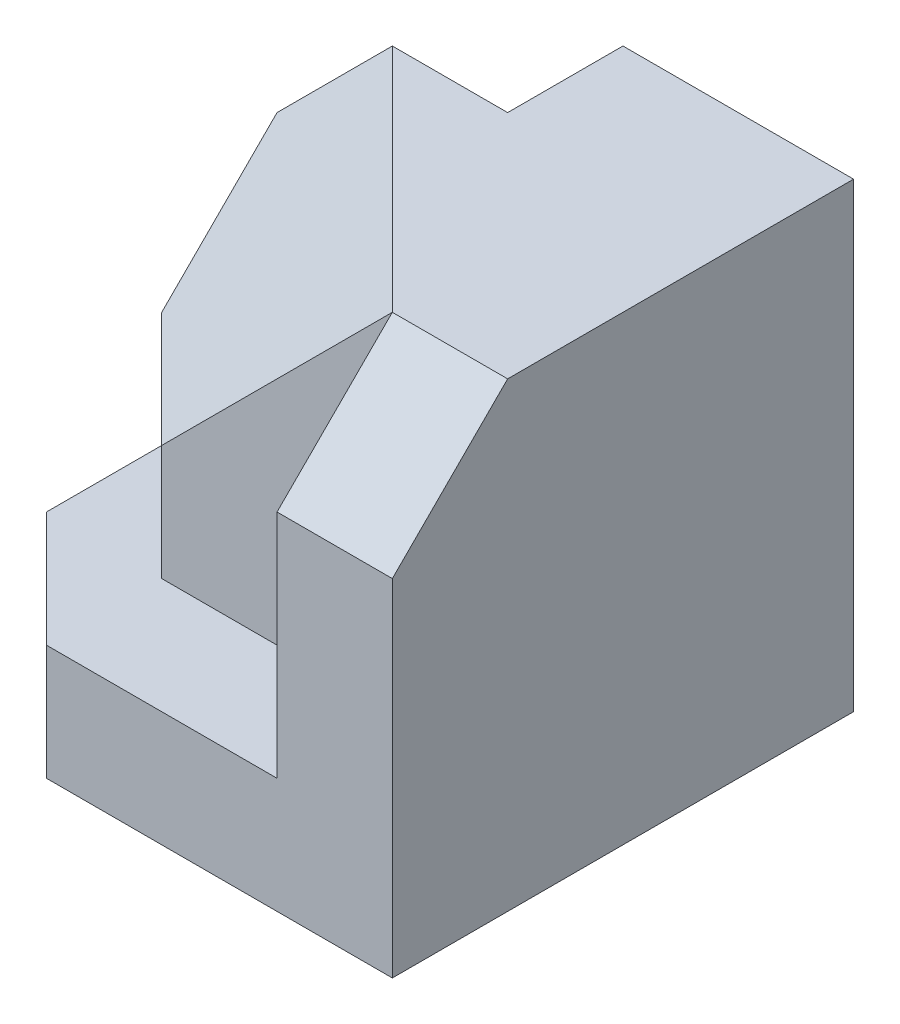
ISO-10303-21;
HEADER;
FILE_DESCRIPTION(('STEP AP214'),'2;1');
FILE_NAME('part.step','',(''),(''),'','','');
FILE_SCHEMA(('AUTOMOTIVE_DESIGN { 1 0 10303 214 1 1 1 1 }'));
ENDSEC;
DATA;
#1=APPLICATION_CONTEXT('core data for automotive mechanical design processes');
#2=APPLICATION_PROTOCOL_DEFINITION('international standard','automotive_design',2000,#1);
#3=PRODUCT_CONTEXT('',#1,'mechanical');
#4=PRODUCT('Part','Part','',(#3));
#5=PRODUCT_RELATED_PRODUCT_CATEGORY('part','',(#4));
#6=PRODUCT_DEFINITION_FORMATION('','',#4);
#7=PRODUCT_DEFINITION_CONTEXT('part definition',#1,'design');
#8=PRODUCT_DEFINITION('design','',#6,#7);
#9=PRODUCT_DEFINITION_SHAPE('','',#8);
#10=(LENGTH_UNIT() NAMED_UNIT(*) SI_UNIT(.MILLI.,.METRE.));
#11=(NAMED_UNIT(*) PLANE_ANGLE_UNIT() SI_UNIT($,.RADIAN.));
#12=(NAMED_UNIT(*) SI_UNIT($,.STERADIAN.) SOLID_ANGLE_UNIT());
#13=UNCERTAINTY_MEASURE_WITH_UNIT(LENGTH_MEASURE(1.E-05),#10,'distance_accuracy_value','');
#14=(GEOMETRIC_REPRESENTATION_CONTEXT(3) GLOBAL_UNCERTAINTY_ASSIGNED_CONTEXT((#13)) GLOBAL_UNIT_ASSIGNED_CONTEXT((#10,
#11,#12)) REPRESENTATION_CONTEXT('',''));
#15=CARTESIAN_POINT('',(0.,0.,0.));
#16=DIRECTION('',(0.,0.,1.));
#17=DIRECTION('',(1.,0.,0.));
#18=AXIS2_PLACEMENT_3D('',#15,#16,#17);
#19=CARTESIAN_POINT('',(5.,20.,15.));
#20=DIRECTION('',(0.,0.,1.));
#21=DIRECTION('',(1.,0.,0.));
#22=AXIS2_PLACEMENT_3D('',#19,#20,#21);
#23=PLANE('',#22);
#24=DIRECTION('',(1.,0.,0.));
#25=VECTOR('',#24,1.);
#26=CARTESIAN_POINT('',(0.,5.,15.));
#27=LINE('',#26,#25);
#28=CARTESIAN_POINT('',(-5.,5.,15.));
#29=VERTEX_POINT('',#28);
#30=CARTESIAN_POINT('',(0.,5.,15.));
#31=VERTEX_POINT('',#30);
#32=EDGE_CURVE('E150',#29,#31,#27,.T.);
#33=ORIENTED_EDGE('',*,*,#32,.T.);
#34=DIRECTION('',(0.,-1.,0.));
#35=VECTOR('',#34,1.);
#36=CARTESIAN_POINT('',(0.,10.,15.));
#37=LINE('',#36,#35);
#38=CARTESIAN_POINT('',(0.,10.,15.));
#39=VERTEX_POINT('',#38);
#40=EDGE_CURVE('E53',#39,#31,#37,.T.);
#41=ORIENTED_EDGE('',*,*,#40,.F.);
#42=DIRECTION('',(-1.,0.,0.));
#43=VECTOR('',#42,1.);
#44=CARTESIAN_POINT('',(5.,10.,15.));
#45=LINE('',#44,#43);
#46=CARTESIAN_POINT('',(5.,10.,15.));
#47=VERTEX_POINT('',#46);
#48=EDGE_CURVE('E58',#47,#39,#45,.T.);
#49=ORIENTED_EDGE('',*,*,#48,.F.);
#50=DIRECTION('',(0.,-1.,0.));
#51=VECTOR('',#50,1.);
#52=CARTESIAN_POINT('',(5.,20.,15.));
#53=LINE('',#52,#51);
#54=CARTESIAN_POINT('',(5.,20.,15.));
#55=VERTEX_POINT('',#54);
#56=EDGE_CURVE('E12',#55,#47,#53,.T.);
#57=ORIENTED_EDGE('',*,*,#56,.F.);
#58=DIRECTION('',(0.707106781186548,0.707106781186548,0.));
#59=VECTOR('',#58,1.);
#60=CARTESIAN_POINT('',(-5.,10.,15.));
#61=LINE('',#60,#59);
#62=CARTESIAN_POINT('',(-5.,10.,15.));
#63=VERTEX_POINT('',#62);
#64=EDGE_CURVE('E195',#63,#55,#61,.T.);
#65=ORIENTED_EDGE('',*,*,#64,.F.);
#66=DIRECTION('',(0.,-1.,0.));
#67=VECTOR('',#66,1.);
#68=CARTESIAN_POINT('',(-5.,20.,15.));
#69=LINE('',#68,#67);
#70=EDGE_CURVE('E194',#63,#29,#69,.T.);
#71=ORIENTED_EDGE('',*,*,#70,.T.);
#72=EDGE_LOOP('',(#33,#41,#49,#57,#65,#71));
#73=FACE_BOUND('',#72,.T.);
#74=ADVANCED_FACE('F36',(#73),#23,.T.);
#75=CARTESIAN_POINT('',(5.,0.,20.));
#76=DIRECTION('',(1.,0.,0.));
#77=DIRECTION('',(0.,0.,-1.));
#78=AXIS2_PLACEMENT_3D('',#75,#76,#77);
#79=PLANE('',#78);
#80=DIRECTION('',(0.,0.,-1.));
#81=VECTOR('',#80,1.);
#82=CARTESIAN_POINT('',(5.,10.,20.));
#83=LINE('',#82,#81);
#84=CARTESIAN_POINT('',(5.,10.,20.));
#85=VERTEX_POINT('',#84);
#86=EDGE_CURVE('E162',#85,#47,#83,.T.);
#87=ORIENTED_EDGE('',*,*,#86,.F.);
#88=DIRECTION('',(0.,-1.,0.));
#89=VECTOR('',#88,1.);
#90=CARTESIAN_POINT('',(5.,0.,20.));
#91=LINE('',#90,#89);
#92=CARTESIAN_POINT('',(5.,15.,20.));
#93=VERTEX_POINT('',#92);
#94=EDGE_CURVE('E159',#93,#85,#91,.T.);
#95=ORIENTED_EDGE('',*,*,#94,.F.);
#96=DIRECTION('',(0.,-0.707106781186548,0.707106781186547));
#97=VECTOR('',#96,1.);
#98=CARTESIAN_POINT('',(5.,20.,15.));
#99=LINE('',#98,#97);
#100=EDGE_CURVE('E233',#55,#93,#99,.T.);
#101=ORIENTED_EDGE('',*,*,#100,.F.);
#102=ORIENTED_EDGE('',*,*,#56,.T.);
#103=EDGE_LOOP('',(#87,#95,#101,#102));
#104=FACE_BOUND('',#103,.T.);
#105=ADVANCED_FACE('F300',(#104),#79,.F.);
#106=CARTESIAN_POINT('',(0.,5.,0.));
#107=DIRECTION('',(0.,-1.,0.));
#108=DIRECTION('',(0.,0.,-1.));
#109=AXIS2_PLACEMENT_3D('',#106,#107,#108);
#110=PLANE('',#109);
#111=DIRECTION('',(0.707106781186547,0.,0.707106781186548));
#112=VECTOR('',#111,1.);
#113=CARTESIAN_POINT('',(0.,5.,15.));
#114=LINE('',#113,#112);
#115=CARTESIAN_POINT('',(5.,5.,20.));
#116=VERTEX_POINT('',#115);
#117=EDGE_CURVE('E143',#31,#116,#114,.T.);
#118=ORIENTED_EDGE('',*,*,#117,.F.);
#119=ORIENTED_EDGE('',*,*,#32,.F.);
#120=DIRECTION('',(0.707106781186548,0.,0.707106781186547));
#121=VECTOR('',#120,1.);
#122=CARTESIAN_POINT('',(-10.,5.,10.));
#123=LINE('',#122,#121);
#124=CARTESIAN_POINT('',(-10.,5.,10.));
#125=VERTEX_POINT('',#124);
#126=EDGE_CURVE('E177',#125,#29,#123,.T.);
#127=ORIENTED_EDGE('',*,*,#126,.F.);
#128=DIRECTION('',(0.,0.,-1.));
#129=VECTOR('',#128,1.);
#130=CARTESIAN_POINT('',(-10.,5.,0.));
#131=LINE('',#130,#129);
#132=CARTESIAN_POINT('',(-10.,5.,15.));
#133=VERTEX_POINT('',#132);
#134=EDGE_CURVE('E174',#133,#125,#131,.T.);
#135=ORIENTED_EDGE('',*,*,#134,.F.);
#136=DIRECTION('',(-0.707106781186548,0.,-0.707106781186547));
#137=VECTOR('',#136,1.);
#138=CARTESIAN_POINT('',(-12.5,5.,12.5));
#139=LINE('',#138,#137);
#140=CARTESIAN_POINT('',(-5.,5.,20.));
#141=VERTEX_POINT('',#140);
#142=EDGE_CURVE('E146',#141,#133,#139,.T.);
#143=ORIENTED_EDGE('',*,*,#142,.F.);
#144=DIRECTION('',(-1.,0.,0.));
#145=VECTOR('',#144,1.);
#146=CARTESIAN_POINT('',(0.,5.,20.));
#147=LINE('',#146,#145);
#148=EDGE_CURVE('E139',#116,#141,#147,.T.);
#149=ORIENTED_EDGE('',*,*,#148,.F.);
#150=EDGE_LOOP('',(#118,#119,#127,#135,#143,#149));
#151=FACE_BOUND('',#150,.T.);
#152=ADVANCED_FACE('F141',(#151),#110,.F.);
#153=CARTESIAN_POINT('',(-5.,20.,15.));
#154=DIRECTION('',(-0.707106781186547,0.,0.707106781186548));
#155=DIRECTION('',(0.707106781186548,0.,0.707106781186547));
#156=AXIS2_PLACEMENT_3D('',#153,#154,#155);
#157=PLANE('',#156);
#158=DIRECTION('',(0.,-1.,0.));
#159=VECTOR('',#158,1.);
#160=CARTESIAN_POINT('',(-10.,20.,10.));
#161=LINE('',#160,#159);
#162=CARTESIAN_POINT('',(-10.,10.,10.));
#163=VERTEX_POINT('',#162);
#164=EDGE_CURVE('E213',#163,#125,#161,.T.);
#165=ORIENTED_EDGE('',*,*,#164,.T.);
#166=ORIENTED_EDGE('',*,*,#126,.T.);
#167=ORIENTED_EDGE('',*,*,#70,.F.);
#168=DIRECTION('',(0.707106781186548,0.,0.707106781186547));
#169=VECTOR('',#168,1.);
#170=CARTESIAN_POINT('',(-10.,10.,10.));
#171=LINE('',#170,#169);
#172=EDGE_CURVE('E192',#163,#63,#171,.T.);
#173=ORIENTED_EDGE('',*,*,#172,.F.);
#174=EDGE_LOOP('',(#165,#166,#167,#173));
#175=FACE_BOUND('',#174,.T.);
#176=ADVANCED_FACE('F319',(#175),#157,.T.);
#177=CARTESIAN_POINT('',(0.,0.,5.));
#178=DIRECTION('',(0.,0.,1.));
#179=DIRECTION('',(1.,0.,0.));
#180=AXIS2_PLACEMENT_3D('',#177,#178,#179);
#181=PLANE('',#180);
#182=DIRECTION('',(-0.707106781186547,-0.707106781186548,0.));
#183=VECTOR('',#182,1.);
#184=CARTESIAN_POINT('',(-5.,20.,5.));
#185=LINE('',#184,#183);
#186=CARTESIAN_POINT('',(-5.,20.,5.));
#187=VERTEX_POINT('',#186);
#188=CARTESIAN_POINT('',(-10.,15.,5.));
#189=VERTEX_POINT('',#188);
#190=EDGE_CURVE('E189',#187,#189,#185,.T.);
#191=ORIENTED_EDGE('',*,*,#190,.F.);
#192=DIRECTION('',(1.,0.,0.));
#193=VECTOR('',#192,1.);
#194=CARTESIAN_POINT('',(0.,20.,5.));
#195=LINE('',#194,#193);
#196=CARTESIAN_POINT('',(0.,20.,5.));
#197=VERTEX_POINT('',#196);
#198=EDGE_CURVE('E219',#187,#197,#195,.T.);
#199=ORIENTED_EDGE('',*,*,#198,.T.);
#200=DIRECTION('',(-0.707106781186547,-0.707106781186548,0.));
#201=VECTOR('',#200,1.);
#202=CARTESIAN_POINT('',(-5.,15.,5.));
#203=LINE('',#202,#201);
#204=CARTESIAN_POINT('',(-5.,15.,5.));
#205=VERTEX_POINT('',#204);
#206=EDGE_CURVE('E222',#197,#205,#203,.T.);
#207=ORIENTED_EDGE('',*,*,#206,.T.);
#208=DIRECTION('',(1.,0.,0.));
#209=VECTOR('',#208,1.);
#210=CARTESIAN_POINT('',(-10.,15.,5.));
#211=LINE('',#210,#209);
#212=EDGE_CURVE('E230',#189,#205,#211,.T.);
#213=ORIENTED_EDGE('',*,*,#212,.F.);
#214=EDGE_LOOP('',(#191,#199,#207,#213));
#215=FACE_BOUND('',#214,.T.);
#216=ADVANCED_FACE('F323',(#215),#181,.F.);
#217=CARTESIAN_POINT('',(-10.,0.,0.));
#218=DIRECTION('',(1.,0.,0.));
#219=DIRECTION('',(0.,0.,-1.));
#220=AXIS2_PLACEMENT_3D('',#217,#218,#219);
#221=PLANE('',#220);
#222=DIRECTION('',(0.,-0.707106781186547,0.707106781186548));
#223=VECTOR('',#222,1.);
#224=CARTESIAN_POINT('',(-10.,15.,5.));
#225=LINE('',#224,#223);
#226=EDGE_CURVE('E185',#189,#163,#225,.T.);
#227=ORIENTED_EDGE('',*,*,#226,.F.);
#228=DIRECTION('',(0.,0.,-1.));
#229=VECTOR('',#228,1.);
#230=CARTESIAN_POINT('',(-10.,15.,0.));
#231=LINE('',#230,#229);
#232=CARTESIAN_POINT('',(-10.,15.,0.));
#233=VERTEX_POINT('',#232);
#234=EDGE_CURVE('E273',#189,#233,#231,.T.);
#235=ORIENTED_EDGE('',*,*,#234,.T.);
#236=DIRECTION('',(0.,-1.,0.));
#237=VECTOR('',#236,1.);
#238=CARTESIAN_POINT('',(-10.,0.,0.));
#239=LINE('',#238,#237);
#240=CARTESIAN_POINT('',(-10.,0.,0.));
#241=VERTEX_POINT('',#240);
#242=EDGE_CURVE('E217',#233,#241,#239,.T.);
#243=ORIENTED_EDGE('',*,*,#242,.T.);
#244=DIRECTION('',(0.,0.,1.));
#245=VECTOR('',#244,1.);
#246=CARTESIAN_POINT('',(-10.,0.,0.));
#247=LINE('',#246,#245);
#248=CARTESIAN_POINT('',(-10.,0.,15.));
#249=VERTEX_POINT('',#248);
#250=EDGE_CURVE('E269',#241,#249,#247,.T.);
#251=ORIENTED_EDGE('',*,*,#250,.T.);
#252=DIRECTION('',(0.,-1.,0.));
#253=VECTOR('',#252,1.);
#254=CARTESIAN_POINT('',(-10.,5.,15.));
#255=LINE('',#254,#253);
#256=EDGE_CURVE('E149',#133,#249,#255,.T.);
#257=ORIENTED_EDGE('',*,*,#256,.F.);
#258=ORIENTED_EDGE('',*,*,#134,.T.);
#259=ORIENTED_EDGE('',*,*,#164,.F.);
#260=EDGE_LOOP('',(#227,#235,#243,#251,#257,#258,#259));
#261=FACE_BOUND('',#260,.T.);
#262=ADVANCED_FACE('F276',(#261),#221,.F.);
#263=CARTESIAN_POINT('',(10.,20.,0.));
#264=DIRECTION('',(-1.,0.,0.));
#265=DIRECTION('',(0.,0.,1.));
#266=AXIS2_PLACEMENT_3D('',#263,#264,#265);
#267=PLANE('',#266);
#268=DIRECTION('',(0.,0.,-1.));
#269=VECTOR('',#268,1.);
#270=CARTESIAN_POINT('',(10.,20.,0.));
#271=LINE('',#270,#269);
#272=CARTESIAN_POINT('',(10.,20.,15.));
#273=VERTEX_POINT('',#272);
#274=CARTESIAN_POINT('',(10.,20.,0.));
#275=VERTEX_POINT('',#274);
#276=EDGE_CURVE('E249',#273,#275,#271,.T.);
#277=ORIENTED_EDGE('',*,*,#276,.F.);
#278=DIRECTION('',(0.,-0.707106781186548,0.707106781186547));
#279=VECTOR('',#278,1.);
#280=CARTESIAN_POINT('',(10.,20.,15.));
#281=LINE('',#280,#279);
#282=CARTESIAN_POINT('',(10.,15.,20.));
#283=VERTEX_POINT('',#282);
#284=EDGE_CURVE('E236',#273,#283,#281,.T.);
#285=ORIENTED_EDGE('',*,*,#284,.T.);
#286=DIRECTION('',(0.,1.,0.));
#287=VECTOR('',#286,1.);
#288=CARTESIAN_POINT('',(10.,0.,20.));
#289=LINE('',#288,#287);
#290=CARTESIAN_POINT('',(10.,0.,20.));
#291=VERTEX_POINT('',#290);
#292=EDGE_CURVE('E246',#291,#283,#289,.T.);
#293=ORIENTED_EDGE('',*,*,#292,.F.);
#294=DIRECTION('',(0.,0.,-1.));
#295=VECTOR('',#294,1.);
#296=CARTESIAN_POINT('',(10.,0.,0.));
#297=LINE('',#296,#295);
#298=CARTESIAN_POINT('',(10.,0.,0.));
#299=VERTEX_POINT('',#298);
#300=EDGE_CURVE('E248',#291,#299,#297,.T.);
#301=ORIENTED_EDGE('',*,*,#300,.T.);
#302=DIRECTION('',(0.,-1.,0.));
#303=VECTOR('',#302,1.);
#304=CARTESIAN_POINT('',(10.,20.,0.));
#305=LINE('',#304,#303);
#306=EDGE_CURVE('E45',#275,#299,#305,.T.);
#307=ORIENTED_EDGE('',*,*,#306,.F.);
#308=EDGE_LOOP('',(#277,#285,#293,#301,#307));
#309=FACE_BOUND('',#308,.T.);
#310=ADVANCED_FACE('F38',(#309),#267,.F.);
#311=CARTESIAN_POINT('',(0.,20.,0.));
#312=DIRECTION('',(0.,0.,1.));
#313=DIRECTION('',(1.,0.,0.));
#314=AXIS2_PLACEMENT_3D('',#311,#312,#313);
#315=PLANE('',#314);
#316=DIRECTION('',(-1.,0.,0.));
#317=VECTOR('',#316,1.);
#318=CARTESIAN_POINT('',(0.,0.,0.));
#319=LINE('',#318,#317);
#320=EDGE_CURVE('E252',#299,#241,#319,.T.);
#321=ORIENTED_EDGE('',*,*,#320,.T.);
#322=ORIENTED_EDGE('',*,*,#242,.F.);
#323=DIRECTION('',(1.,0.,0.));
#324=VECTOR('',#323,1.);
#325=CARTESIAN_POINT('',(-10.,15.,0.));
#326=LINE('',#325,#324);
#327=CARTESIAN_POINT('',(-5.,15.,0.));
#328=VERTEX_POINT('',#327);
#329=EDGE_CURVE('E280',#233,#328,#326,.T.);
#330=ORIENTED_EDGE('',*,*,#329,.T.);
#331=DIRECTION('',(-0.707106781186547,-0.707106781186548,0.));
#332=VECTOR('',#331,1.);
#333=CARTESIAN_POINT('',(-5.,15.,0.));
#334=LINE('',#333,#332);
#335=CARTESIAN_POINT('',(0.,20.,0.));
#336=VERTEX_POINT('',#335);
#337=EDGE_CURVE('E228',#336,#328,#334,.T.);
#338=ORIENTED_EDGE('',*,*,#337,.F.);
#339=DIRECTION('',(-1.,0.,0.));
#340=VECTOR('',#339,1.);
#341=CARTESIAN_POINT('',(0.,20.,0.));
#342=LINE('',#341,#340);
#343=EDGE_CURVE('E251',#275,#336,#342,.T.);
#344=ORIENTED_EDGE('',*,*,#343,.F.);
#345=ORIENTED_EDGE('',*,*,#306,.T.);
#346=EDGE_LOOP('',(#321,#322,#330,#338,#344,#345));
#347=FACE_BOUND('',#346,.T.);
#348=ADVANCED_FACE('F261',(#347),#315,.F.);
#349=CARTESIAN_POINT('',(0.,20.,0.));
#350=DIRECTION('',(0.,-1.,0.));
#351=DIRECTION('',(0.,0.,-1.));
#352=AXIS2_PLACEMENT_3D('',#349,#350,#351);
#353=PLANE('',#352);
#354=ORIENTED_EDGE('',*,*,#198,.F.);
#355=DIRECTION('',(-0.707106781186548,0.,-0.707106781186547));
#356=VECTOR('',#355,1.);
#357=CARTESIAN_POINT('',(5.,20.,15.));
#358=LINE('',#357,#356);
#359=EDGE_CURVE('E199',#55,#187,#358,.T.);
#360=ORIENTED_EDGE('',*,*,#359,.F.);
#361=DIRECTION('',(-1.,0.,0.));
#362=VECTOR('',#361,1.);
#363=CARTESIAN_POINT('',(10.,20.,15.));
#364=LINE('',#363,#362);
#365=EDGE_CURVE('E239',#273,#55,#364,.T.);
#366=ORIENTED_EDGE('',*,*,#365,.F.);
#367=ORIENTED_EDGE('',*,*,#276,.T.);
#368=ORIENTED_EDGE('',*,*,#343,.T.);
#369=DIRECTION('',(0.,0.,-1.));
#370=VECTOR('',#369,1.);
#371=CARTESIAN_POINT('',(0.,20.,5.));
#372=LINE('',#371,#370);
#373=EDGE_CURVE('E231',#197,#336,#372,.T.);
#374=ORIENTED_EDGE('',*,*,#373,.F.);
#375=EDGE_LOOP('',(#354,#360,#366,#367,#368,#374));
#376=FACE_BOUND('',#375,.T.);
#377=ADVANCED_FACE('F340',(#376),#353,.F.);
#378=CARTESIAN_POINT('',(0.,0.,0.));
#379=DIRECTION('',(0.,-1.,0.));
#380=DIRECTION('',(0.,0.,-1.));
#381=AXIS2_PLACEMENT_3D('',#378,#379,#380);
#382=PLANE('',#381);
#383=DIRECTION('',(-0.707106781186548,0.,-0.707106781186547));
#384=VECTOR('',#383,1.);
#385=CARTESIAN_POINT('',(-12.5,0.,12.5));
#386=LINE('',#385,#384);
#387=CARTESIAN_POINT('',(-5.,0.,20.));
#388=VERTEX_POINT('',#387);
#389=EDGE_CURVE('E172',#388,#249,#386,.T.);
#390=ORIENTED_EDGE('',*,*,#389,.T.);
#391=ORIENTED_EDGE('',*,*,#250,.F.);
#392=ORIENTED_EDGE('',*,*,#320,.F.);
#393=ORIENTED_EDGE('',*,*,#300,.F.);
#394=DIRECTION('',(1.,0.,0.));
#395=VECTOR('',#394,1.);
#396=CARTESIAN_POINT('',(5.,0.,20.));
#397=LINE('',#396,#395);
#398=EDGE_CURVE('E243',#388,#291,#397,.T.);
#399=ORIENTED_EDGE('',*,*,#398,.F.);
#400=EDGE_LOOP('',(#390,#391,#392,#393,#399));
#401=FACE_BOUND('',#400,.T.);
#402=ADVANCED_FACE('F268',(#401),#382,.T.);
#403=CARTESIAN_POINT('',(0.,0.,20.));
#404=DIRECTION('',(0.,0.,-1.));
#405=DIRECTION('',(-1.,0.,0.));
#406=AXIS2_PLACEMENT_3D('',#403,#404,#405);
#407=PLANE('',#406);
#408=ORIENTED_EDGE('',*,*,#292,.T.);
#409=DIRECTION('',(-1.,0.,0.));
#410=VECTOR('',#409,1.);
#411=CARTESIAN_POINT('',(10.,15.,20.));
#412=LINE('',#411,#410);
#413=EDGE_CURVE('E240',#283,#93,#412,.T.);
#414=ORIENTED_EDGE('',*,*,#413,.T.);
#415=ORIENTED_EDGE('',*,*,#94,.T.);
#416=DIRECTION('',(0.,-1.,0.));
#417=VECTOR('',#416,1.);
#418=CARTESIAN_POINT('',(5.,10.,20.));
#419=LINE('',#418,#417);
#420=EDGE_CURVE('E154',#85,#116,#419,.T.);
#421=ORIENTED_EDGE('',*,*,#420,.T.);
#422=ORIENTED_EDGE('',*,*,#148,.T.);
#423=DIRECTION('',(0.,-1.,0.));
#424=VECTOR('',#423,1.);
#425=CARTESIAN_POINT('',(-5.,5.,20.));
#426=LINE('',#425,#424);
#427=EDGE_CURVE('E183',#141,#388,#426,.T.);
#428=ORIENTED_EDGE('',*,*,#427,.T.);
#429=ORIENTED_EDGE('',*,*,#398,.T.);
#430=EDGE_LOOP('',(#408,#414,#415,#421,#422,#428,#429));
#431=FACE_BOUND('',#430,.T.);
#432=ADVANCED_FACE('F156',(#431),#407,.F.);
#433=CARTESIAN_POINT('',(10.,20.,15.));
#434=DIRECTION('',(0.,-0.707106781186547,-0.707106781186548));
#435=DIRECTION('',(0.,0.707106781186548,-0.707106781186547));
#436=AXIS2_PLACEMENT_3D('',#433,#434,#435);
#437=PLANE('',#436);
#438=ORIENTED_EDGE('',*,*,#100,.T.);
#439=ORIENTED_EDGE('',*,*,#413,.F.);
#440=ORIENTED_EDGE('',*,*,#284,.F.);
#441=ORIENTED_EDGE('',*,*,#365,.T.);
#442=EDGE_LOOP('',(#438,#439,#440,#441));
#443=FACE_BOUND('',#442,.T.);
#444=ADVANCED_FACE('F296',(#443),#437,.F.);
#445=CARTESIAN_POINT('',(-5.,15.,5.));
#446=DIRECTION('',(0.707106781186548,-0.707106781186547,0.));
#447=DIRECTION('',(0.707106781186547,0.707106781186548,0.));
#448=AXIS2_PLACEMENT_3D('',#445,#446,#447);
#449=PLANE('',#448);
#450=ORIENTED_EDGE('',*,*,#337,.T.);
#451=DIRECTION('',(0.,0.,-1.));
#452=VECTOR('',#451,1.);
#453=CARTESIAN_POINT('',(-5.,15.,5.));
#454=LINE('',#453,#452);
#455=EDGE_CURVE('E221',#205,#328,#454,.T.);
#456=ORIENTED_EDGE('',*,*,#455,.F.);
#457=ORIENTED_EDGE('',*,*,#206,.F.);
#458=ORIENTED_EDGE('',*,*,#373,.T.);
#459=EDGE_LOOP('',(#450,#456,#457,#458));
#460=FACE_BOUND('',#459,.T.);
#461=ADVANCED_FACE('F328',(#460),#449,.F.);
#462=CARTESIAN_POINT('',(-10.,15.,0.));
#463=DIRECTION('',(0.,-1.,0.));
#464=DIRECTION('',(0.,0.,-1.));
#465=AXIS2_PLACEMENT_3D('',#462,#463,#464);
#466=PLANE('',#465);
#467=ORIENTED_EDGE('',*,*,#455,.T.);
#468=ORIENTED_EDGE('',*,*,#329,.F.);
#469=ORIENTED_EDGE('',*,*,#234,.F.);
#470=ORIENTED_EDGE('',*,*,#212,.T.);
#471=EDGE_LOOP('',(#467,#468,#469,#470));
#472=FACE_BOUND('',#471,.T.);
#473=ADVANCED_FACE('F324',(#472),#466,.F.);
#474=CARTESIAN_POINT('',(-10.,10.,9.99999999999998));
#475=DIRECTION('',(-0.577350269189626,0.577350269189626,0.577350269189625));
#476=DIRECTION('',(-0.707106781186548,-0.707106781186547,0.));
#477=AXIS2_PLACEMENT_3D('',#474,#475,#476);
#478=PLANE('',#477);
#479=ORIENTED_EDGE('',*,*,#226,.T.);
#480=ORIENTED_EDGE('',*,*,#172,.T.);
#481=ORIENTED_EDGE('',*,*,#64,.T.);
#482=ORIENTED_EDGE('',*,*,#359,.T.);
#483=ORIENTED_EDGE('',*,*,#190,.T.);
#484=EDGE_LOOP('',(#479,#480,#481,#482,#483));
#485=FACE_BOUND('',#484,.T.);
#486=ADVANCED_FACE('F327',(#485),#478,.T.);
#487=CARTESIAN_POINT('',(-12.5,5.,12.5));
#488=DIRECTION('',(-0.707106781186547,0.,0.707106781186548));
#489=DIRECTION('',(0.707106781186548,0.,0.707106781186547));
#490=AXIS2_PLACEMENT_3D('',#487,#488,#489);
#491=PLANE('',#490);
#492=ORIENTED_EDGE('',*,*,#389,.F.);
#493=ORIENTED_EDGE('',*,*,#427,.F.);
#494=ORIENTED_EDGE('',*,*,#142,.T.);
#495=ORIENTED_EDGE('',*,*,#256,.T.);
#496=EDGE_LOOP('',(#492,#493,#494,#495));
#497=FACE_BOUND('',#496,.T.);
#498=ADVANCED_FACE('F309',(#497),#491,.T.);
#499=CARTESIAN_POINT('',(0.,10.,15.));
#500=DIRECTION('',(0.707106781186548,0.,-0.707106781186547));
#501=DIRECTION('',(-0.707106781186547,0.,-0.707106781186548));
#502=AXIS2_PLACEMENT_3D('',#499,#500,#501);
#503=PLANE('',#502);
#504=ORIENTED_EDGE('',*,*,#117,.T.);
#505=ORIENTED_EDGE('',*,*,#420,.F.);
#506=DIRECTION('',(0.707106781186547,0.,0.707106781186548));
#507=VECTOR('',#506,1.);
#508=CARTESIAN_POINT('',(0.,10.,15.));
#509=LINE('',#508,#507);
#510=EDGE_CURVE('E166',#39,#85,#509,.T.);
#511=ORIENTED_EDGE('',*,*,#510,.F.);
#512=ORIENTED_EDGE('',*,*,#40,.T.);
#513=EDGE_LOOP('',(#504,#505,#511,#512));
#514=FACE_BOUND('',#513,.T.);
#515=ADVANCED_FACE('F164',(#514),#503,.F.);
#516=CARTESIAN_POINT('',(0.,10.,0.));
#517=DIRECTION('',(0.,-1.,0.));
#518=DIRECTION('',(0.,0.,-1.));
#519=AXIS2_PLACEMENT_3D('',#516,#517,#518);
#520=PLANE('',#519);
#521=ORIENTED_EDGE('',*,*,#48,.T.);
#522=ORIENTED_EDGE('',*,*,#510,.T.);
#523=ORIENTED_EDGE('',*,*,#86,.T.);
#524=EDGE_LOOP('',(#521,#522,#523));
#525=FACE_BOUND('',#524,.T.);
#526=ADVANCED_FACE('F303',(#525),#520,.F.);
#527=CLOSED_SHELL('',(#74,#105,#152,#176,#216,#262,#310,#348,#377,#402,#432,#444,#461,#473,#486,
#498,#515,#526));
#528=MANIFOLD_SOLID_BREP('B2',#527);
#529=ADVANCED_BREP_SHAPE_REPRESENTATION('',(#18,#528),#14);
#530=SHAPE_DEFINITION_REPRESENTATION(#9,#529);
ENDSEC;
END-ISO-10303-21;
